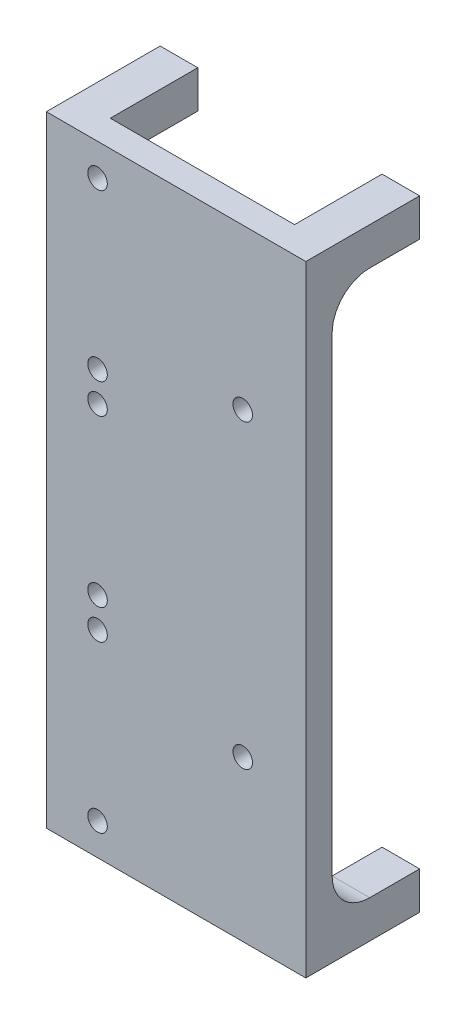
ISO-10303-21;
HEADER;
FILE_DESCRIPTION(('STEP AP214'),'2;1');
FILE_NAME('part.step','',(''),(''),'','','');
FILE_SCHEMA(('AUTOMOTIVE_DESIGN { 1 0 10303 214 1 1 1 1 }'));
ENDSEC;
DATA;
#1=APPLICATION_CONTEXT('core data for automotive mechanical design processes');
#2=APPLICATION_PROTOCOL_DEFINITION('international standard','automotive_design',2000,#1);
#3=PRODUCT_CONTEXT('',#1,'mechanical');
#4=PRODUCT('Part','Part','',(#3));
#5=PRODUCT_RELATED_PRODUCT_CATEGORY('part','',(#4));
#6=PRODUCT_DEFINITION_FORMATION('','',#4);
#7=PRODUCT_DEFINITION_CONTEXT('part definition',#1,'design');
#8=PRODUCT_DEFINITION('design','',#6,#7);
#9=PRODUCT_DEFINITION_SHAPE('','',#8);
#10=(LENGTH_UNIT() NAMED_UNIT(*) SI_UNIT(.MILLI.,.METRE.));
#11=(NAMED_UNIT(*) PLANE_ANGLE_UNIT() SI_UNIT($,.RADIAN.));
#12=(NAMED_UNIT(*) SI_UNIT($,.STERADIAN.) SOLID_ANGLE_UNIT());
#13=UNCERTAINTY_MEASURE_WITH_UNIT(LENGTH_MEASURE(1.E-05),#10,'distance_accuracy_value','');
#14=(GEOMETRIC_REPRESENTATION_CONTEXT(3) GLOBAL_UNCERTAINTY_ASSIGNED_CONTEXT((#13)) GLOBAL_UNIT_ASSIGNED_CONTEXT((#10,
#11,#12)) REPRESENTATION_CONTEXT('',''));
#15=CARTESIAN_POINT('',(0.,0.,0.));
#16=DIRECTION('',(0.,0.,1.));
#17=DIRECTION('',(1.,0.,0.));
#18=AXIS2_PLACEMENT_3D('',#15,#16,#17);
#19=CARTESIAN_POINT('',(0.,0.,0.));
#20=DIRECTION('',(0.,0.,-1.));
#21=DIRECTION('',(-1.,0.,0.));
#22=AXIS2_PLACEMENT_3D('',#19,#20,#21);
#23=PLANE('',#22);
#24=CARTESIAN_POINT('',(71.2675267467333,-59.6714206568418,0.));
#25=DIRECTION('',(0.,0.,-1.));
#26=DIRECTION('',(-1.,0.,0.));
#27=AXIS2_PLACEMENT_3D('',#24,#25,#26);
#28=CIRCLE('',#27,2.6);
#29=CARTESIAN_POINT('',(68.6675267467332,-59.6714206568418,0.));
#30=VERTEX_POINT('',#29);
#31=EDGE_CURVE('E344',#30,#30,#28,.F.);
#32=ORIENTED_EDGE('',*,*,#31,.T.);
#33=EDGE_LOOP('',(#32));
#34=FACE_BOUND('',#33,.T.);
#35=CARTESIAN_POINT('',(71.2675267467333,-15.6714206568418,0.));
#36=DIRECTION('',(0.,0.,-1.));
#37=DIRECTION('',(-1.,0.,0.));
#38=AXIS2_PLACEMENT_3D('',#35,#36,#37);
#39=CIRCLE('',#38,2.6);
#40=CARTESIAN_POINT('',(68.6675267467332,-15.6714206568418,0.));
#41=VERTEX_POINT('',#40);
#42=EDGE_CURVE('E349',#41,#41,#39,.F.);
#43=ORIENTED_EDGE('',*,*,#42,.T.);
#44=EDGE_LOOP('',(#43));
#45=FACE_BOUND('',#44,.T.);
#46=CARTESIAN_POINT('',(71.2675267467333,-7.67142065684181,0.));
#47=DIRECTION('',(0.,0.,-1.));
#48=DIRECTION('',(-1.,0.,0.));
#49=AXIS2_PLACEMENT_3D('',#46,#47,#48);
#50=CIRCLE('',#49,2.6);
#51=CARTESIAN_POINT('',(68.6675267467332,-7.67142065684181,0.));
#52=VERTEX_POINT('',#51);
#53=EDGE_CURVE('E355',#52,#52,#50,.F.);
#54=ORIENTED_EDGE('',*,*,#53,.T.);
#55=EDGE_LOOP('',(#54));
#56=FACE_BOUND('',#55,.T.);
#57=CARTESIAN_POINT('',(71.2675267467333,36.3285793431582,0.));
#58=DIRECTION('',(0.,0.,-1.));
#59=DIRECTION('',(-1.,0.,0.));
#60=AXIS2_PLACEMENT_3D('',#57,#58,#59);
#61=CIRCLE('',#60,2.6);
#62=CARTESIAN_POINT('',(68.6675267467332,36.3285793431582,0.));
#63=VERTEX_POINT('',#62);
#64=EDGE_CURVE('E361',#63,#63,#61,.F.);
#65=ORIENTED_EDGE('',*,*,#64,.T.);
#66=EDGE_LOOP('',(#65));
#67=FACE_BOUND('',#66,.T.);
#68=CARTESIAN_POINT('',(71.2675267467333,44.3285793431582,0.));
#69=DIRECTION('',(0.,0.,-1.));
#70=DIRECTION('',(-1.,0.,0.));
#71=AXIS2_PLACEMENT_3D('',#68,#69,#70);
#72=CIRCLE('',#71,2.6);
#73=CARTESIAN_POINT('',(68.6675267467332,44.3285793431582,0.));
#74=VERTEX_POINT('',#73);
#75=EDGE_CURVE('E367',#74,#74,#72,.F.);
#76=ORIENTED_EDGE('',*,*,#75,.T.);
#77=EDGE_LOOP('',(#76));
#78=FACE_BOUND('',#77,.T.);
#79=CARTESIAN_POINT('',(71.2675267467333,88.3285793431582,0.));
#80=DIRECTION('',(0.,0.,-1.));
#81=DIRECTION('',(-1.,0.,0.));
#82=AXIS2_PLACEMENT_3D('',#79,#80,#81);
#83=CIRCLE('',#82,2.6);
#84=CARTESIAN_POINT('',(68.6675267467332,88.3285793431582,0.));
#85=VERTEX_POINT('',#84);
#86=EDGE_CURVE('E327',#85,#85,#83,.F.);
#87=ORIENTED_EDGE('',*,*,#86,.T.);
#88=EDGE_LOOP('',(#87));
#89=FACE_BOUND('',#88,.T.);
#90=CARTESIAN_POINT('',(109.883329943437,54.3285793431582,0.));
#91=DIRECTION('',(0.,0.,-1.));
#92=DIRECTION('',(-1.,0.,0.));
#93=AXIS2_PLACEMENT_3D('',#90,#91,#92);
#94=CIRCLE('',#93,2.6);
#95=CARTESIAN_POINT('',(107.283329943437,54.3285793431582,0.));
#96=VERTEX_POINT('',#95);
#97=EDGE_CURVE('E197',#96,#96,#94,.F.);
#98=ORIENTED_EDGE('',*,*,#97,.T.);
#99=EDGE_LOOP('',(#98));
#100=FACE_BOUND('',#99,.T.);
#101=CARTESIAN_POINT('',(109.883329943437,-25.6714206568418,0.));
#102=DIRECTION('',(0.,0.,-1.));
#103=DIRECTION('',(-1.,0.,0.));
#104=AXIS2_PLACEMENT_3D('',#101,#102,#103);
#105=CIRCLE('',#104,2.6);
#106=CARTESIAN_POINT('',(107.283329943437,-25.6714206568418,0.));
#107=VERTEX_POINT('',#106);
#108=EDGE_CURVE('E348',#107,#107,#105,.F.);
#109=ORIENTED_EDGE('',*,*,#108,.T.);
#110=EDGE_LOOP('',(#109));
#111=FACE_BOUND('',#110,.T.);
#112=DIRECTION('',(0.,1.,0.));
#113=VECTOR('',#112,1.);
#114=CARTESIAN_POINT('',(116.660418582241,96.8285793431582,0.));
#115=LINE('',#114,#113);
#116=CARTESIAN_POINT('',(116.660418582241,76.8285793431582,0.));
#117=VERTEX_POINT('',#116);
#118=CARTESIAN_POINT('',(116.660418582241,96.8285793431582,0.));
#119=VERTEX_POINT('',#118);
#120=EDGE_CURVE('E52',#117,#119,#115,.T.);
#121=ORIENTED_EDGE('',*,*,#120,.F.);
#122=DIRECTION('',(-1.,0.,0.));
#123=VECTOR('',#122,1.);
#124=CARTESIAN_POINT('',(0.,76.8285793431582,0.));
#125=LINE('',#124,#123);
#126=CARTESIAN_POINT('',(126.660418582241,76.8285793431582,0.));
#127=VERTEX_POINT('',#126);
#128=EDGE_CURVE('E57',#117,#127,#125,.F.);
#129=ORIENTED_EDGE('',*,*,#128,.T.);
#130=DIRECTION('',(0.,1.,0.));
#131=VECTOR('',#130,1.);
#132=CARTESIAN_POINT('',(126.660418582241,-68.1714206568418,0.));
#133=LINE('',#132,#131);
#134=CARTESIAN_POINT('',(126.660418582241,-48.1714206568418,0.));
#135=VERTEX_POINT('',#134);
#136=EDGE_CURVE('E193',#135,#127,#133,.T.);
#137=ORIENTED_EDGE('',*,*,#136,.F.);
#138=DIRECTION('',(-1.,0.,0.));
#139=VECTOR('',#138,1.);
#140=CARTESIAN_POINT('',(116.660418582241,-48.1714206568418,0.));
#141=LINE('',#140,#139);
#142=CARTESIAN_POINT('',(116.660418582241,-48.1714206568418,0.));
#143=VERTEX_POINT('',#142);
#144=EDGE_CURVE('E232',#135,#143,#141,.T.);
#145=ORIENTED_EDGE('',*,*,#144,.T.);
#146=DIRECTION('',(0.,-1.,0.));
#147=VECTOR('',#146,1.);
#148=CARTESIAN_POINT('',(116.660418582241,-68.1714206568418,0.));
#149=LINE('',#148,#147);
#150=CARTESIAN_POINT('',(116.660418582241,-68.1714206568418,0.));
#151=VERTEX_POINT('',#150);
#152=EDGE_CURVE('E262',#143,#151,#149,.T.);
#153=ORIENTED_EDGE('',*,*,#152,.T.);
#154=DIRECTION('',(1.,0.,0.));
#155=VECTOR('',#154,1.);
#156=CARTESIAN_POINT('',(57.660418582241,-68.1714206568418,0.));
#157=LINE('',#156,#155);
#158=CARTESIAN_POINT('',(67.6604185822411,-68.1714206568418,0.));
#159=VERTEX_POINT('',#158);
#160=EDGE_CURVE('E195',#159,#151,#157,.T.);
#161=ORIENTED_EDGE('',*,*,#160,.F.);
#162=DIRECTION('',(0.,-1.,0.));
#163=VECTOR('',#162,1.);
#164=CARTESIAN_POINT('',(67.660418582241,-68.1714206568418,0.));
#165=LINE('',#164,#163);
#166=CARTESIAN_POINT('',(67.6604185822411,-48.1714206568418,0.));
#167=VERTEX_POINT('',#166);
#168=EDGE_CURVE('E314',#167,#159,#165,.T.);
#169=ORIENTED_EDGE('',*,*,#168,.F.);
#170=DIRECTION('',(1.,0.,0.));
#171=VECTOR('',#170,1.);
#172=CARTESIAN_POINT('',(0.,-48.1714206568418,0.));
#173=LINE('',#172,#171);
#174=CARTESIAN_POINT('',(57.660418582241,-48.1714206568418,0.));
#175=VERTEX_POINT('',#174);
#176=EDGE_CURVE('E216',#167,#175,#173,.F.);
#177=ORIENTED_EDGE('',*,*,#176,.T.);
#178=DIRECTION('',(0.,-1.,0.));
#179=VECTOR('',#178,1.);
#180=CARTESIAN_POINT('',(57.660418582241,-68.1714206568418,0.));
#181=LINE('',#180,#179);
#182=CARTESIAN_POINT('',(57.660418582241,76.8285793431582,0.));
#183=VERTEX_POINT('',#182);
#184=EDGE_CURVE('E192',#183,#175,#181,.T.);
#185=ORIENTED_EDGE('',*,*,#184,.F.);
#186=DIRECTION('',(1.,0.,0.));
#187=VECTOR('',#186,1.);
#188=CARTESIAN_POINT('',(67.6604185822411,76.8285793431582,0.));
#189=LINE('',#188,#187);
#190=CARTESIAN_POINT('',(67.6604185822411,76.8285793431582,0.));
#191=VERTEX_POINT('',#190);
#192=EDGE_CURVE('E224',#183,#191,#189,.T.);
#193=ORIENTED_EDGE('',*,*,#192,.T.);
#194=DIRECTION('',(0.,1.,0.));
#195=VECTOR('',#194,1.);
#196=CARTESIAN_POINT('',(67.660418582241,96.8285793431582,0.));
#197=LINE('',#196,#195);
#198=CARTESIAN_POINT('',(67.6604185822411,96.8285793431582,0.));
#199=VERTEX_POINT('',#198);
#200=EDGE_CURVE('E190',#191,#199,#197,.T.);
#201=ORIENTED_EDGE('',*,*,#200,.T.);
#202=DIRECTION('',(-1.,0.,0.));
#203=VECTOR('',#202,1.);
#204=CARTESIAN_POINT('',(57.660418582241,96.8285793431582,0.));
#205=LINE('',#204,#203);
#206=EDGE_CURVE('E177',#119,#199,#205,.T.);
#207=ORIENTED_EDGE('',*,*,#206,.F.);
#208=EDGE_LOOP('',(#121,#129,#137,#145,#153,#161,#169,#177,#185,#193,#201,#207));
#209=FACE_BOUND('',#208,.T.);
#210=ADVANCED_FACE('F37',(#34,#45,#56,#67,#78,#89,#100,#111,#209),#23,.T.);
#211=CARTESIAN_POINT('',(126.660418582241,-68.1714206568418,7.));
#212=DIRECTION('',(-1.,0.,0.));
#213=DIRECTION('',(0.,0.,1.));
#214=AXIS2_PLACEMENT_3D('',#211,#212,#213);
#215=PLANE('',#214);
#216=DIRECTION('',(0.,0.,-1.));
#217=VECTOR('',#216,1.);
#218=CARTESIAN_POINT('',(126.660418582241,-68.1714206568418,7.));
#219=LINE('',#218,#217);
#220=CARTESIAN_POINT('',(126.660418582241,-68.1714206568418,7.));
#221=VERTEX_POINT('',#220);
#222=CARTESIAN_POINT('',(126.660418582241,-68.1714206568418,-23.2641286914007));
#223=VERTEX_POINT('',#222);
#224=EDGE_CURVE('E204',#221,#223,#219,.T.);
#225=ORIENTED_EDGE('',*,*,#224,.T.);
#226=DIRECTION('',(0.,-1.,0.));
#227=VECTOR('',#226,1.);
#228=CARTESIAN_POINT('',(126.660418582241,-68.1714206568419,-23.2641286914007));
#229=LINE('',#228,#227);
#230=CARTESIAN_POINT('',(126.660418582241,-58.1714206568418,-23.2641286914006));
#231=VERTEX_POINT('',#230);
#232=EDGE_CURVE('E272',#231,#223,#229,.T.);
#233=ORIENTED_EDGE('',*,*,#232,.F.);
#234=DIRECTION('',(0.,0.,1.));
#235=VECTOR('',#234,1.);
#236=CARTESIAN_POINT('',(126.660418582241,-58.1714206568418,-37.4062643151316));
#237=LINE('',#236,#235);
#238=CARTESIAN_POINT('',(126.660418582241,-58.1714206568418,-10.));
#239=VERTEX_POINT('',#238);
#240=EDGE_CURVE('E277',#231,#239,#237,.T.);
#241=ORIENTED_EDGE('',*,*,#240,.T.);
#242=CARTESIAN_POINT('',(126.660418582241,-48.1714206568418,-10.));
#243=DIRECTION('',(-1.,0.,0.));
#244=DIRECTION('',(0.,0.,1.));
#245=AXIS2_PLACEMENT_3D('',#242,#243,#244);
#246=CIRCLE('',#245,10.);
#247=EDGE_CURVE('E239',#239,#135,#246,.T.);
#248=ORIENTED_EDGE('',*,*,#247,.T.);
#249=ORIENTED_EDGE('',*,*,#136,.T.);
#250=CARTESIAN_POINT('',(126.660418582241,76.8285793431582,-10.));
#251=DIRECTION('',(-1.,0.,0.));
#252=DIRECTION('',(0.,0.,1.));
#253=AXIS2_PLACEMENT_3D('',#250,#251,#252);
#254=CIRCLE('',#253,10.);
#255=CARTESIAN_POINT('',(126.660418582241,86.8285793431582,-10.));
#256=VERTEX_POINT('',#255);
#257=EDGE_CURVE('E11',#127,#256,#254,.T.);
#258=ORIENTED_EDGE('',*,*,#257,.T.);
#259=DIRECTION('',(0.,0.,1.));
#260=VECTOR('',#259,1.);
#261=CARTESIAN_POINT('',(126.660418582241,86.8285793431582,-37.4062643151301));
#262=LINE('',#261,#260);
#263=CARTESIAN_POINT('',(126.660418582241,86.8285793431582,-23.2641286913992));
#264=VERTEX_POINT('',#263);
#265=EDGE_CURVE('E251',#264,#256,#262,.T.);
#266=ORIENTED_EDGE('',*,*,#265,.F.);
#267=DIRECTION('',(0.,1.,0.));
#268=VECTOR('',#267,1.);
#269=CARTESIAN_POINT('',(126.660418582241,96.8285793431581,-23.2641286913991));
#270=LINE('',#269,#268);
#271=CARTESIAN_POINT('',(126.660418582241,96.8285793431582,-23.2641286913991));
#272=VERTEX_POINT('',#271);
#273=EDGE_CURVE('E266',#264,#272,#270,.T.);
#274=ORIENTED_EDGE('',*,*,#273,.T.);
#275=DIRECTION('',(0.,0.,-1.));
#276=VECTOR('',#275,1.);
#277=CARTESIAN_POINT('',(126.660418582241,96.8285793431582,7.));
#278=LINE('',#277,#276);
#279=CARTESIAN_POINT('',(126.660418582241,96.8285793431582,7.));
#280=VERTEX_POINT('',#279);
#281=EDGE_CURVE('E211',#280,#272,#278,.T.);
#282=ORIENTED_EDGE('',*,*,#281,.F.);
#283=DIRECTION('',(0.,1.,0.));
#284=VECTOR('',#283,1.);
#285=CARTESIAN_POINT('',(126.660418582241,-68.1714206568418,7.));
#286=LINE('',#285,#284);
#287=EDGE_CURVE('E203',#221,#280,#286,.T.);
#288=ORIENTED_EDGE('',*,*,#287,.F.);
#289=EDGE_LOOP('',(#225,#233,#241,#248,#249,#258,#266,#274,#282,#288));
#290=FACE_BOUND('',#289,.T.);
#291=ADVANCED_FACE('F406',(#290),#215,.F.);
#292=CARTESIAN_POINT('',(57.660418582241,96.8285793431582,7.));
#293=DIRECTION('',(0.,-1.,0.));
#294=DIRECTION('',(0.,0.,-1.));
#295=AXIS2_PLACEMENT_3D('',#292,#293,#294);
#296=PLANE('',#295);
#297=ORIENTED_EDGE('',*,*,#281,.T.);
#298=DIRECTION('',(-1.,0.,0.));
#299=VECTOR('',#298,1.);
#300=CARTESIAN_POINT('',(126.660418582241,96.8285793431582,-23.2641286913991));
#301=LINE('',#300,#299);
#302=CARTESIAN_POINT('',(116.660418582241,96.8285793431582,-23.2641286913991));
#303=VERTEX_POINT('',#302);
#304=EDGE_CURVE('E180',#272,#303,#301,.T.);
#305=ORIENTED_EDGE('',*,*,#304,.T.);
#306=DIRECTION('',(0.,0.,1.));
#307=VECTOR('',#306,1.);
#308=CARTESIAN_POINT('',(116.660418582241,96.8285793431582,-37.4062643151301));
#309=LINE('',#308,#307);
#310=EDGE_CURVE('E174',#303,#119,#309,.T.);
#311=ORIENTED_EDGE('',*,*,#310,.T.);
#312=ORIENTED_EDGE('',*,*,#206,.T.);
#313=DIRECTION('',(0.,0.,1.));
#314=VECTOR('',#313,1.);
#315=CARTESIAN_POINT('',(67.660418582241,96.8285793431582,-37.4062643151301));
#316=LINE('',#315,#314);
#317=CARTESIAN_POINT('',(67.660418582241,96.8285793431582,-23.2641286913991));
#318=VERTEX_POINT('',#317);
#319=EDGE_CURVE('E295',#318,#199,#316,.T.);
#320=ORIENTED_EDGE('',*,*,#319,.F.);
#321=DIRECTION('',(1.,0.,0.));
#322=VECTOR('',#321,1.);
#323=CARTESIAN_POINT('',(57.6604185822411,96.8285793431582,-23.2641286913991));
#324=LINE('',#323,#322);
#325=CARTESIAN_POINT('',(57.660418582241,96.8285793431582,-23.2641286913991));
#326=VERTEX_POINT('',#325);
#327=EDGE_CURVE('E294',#326,#318,#324,.T.);
#328=ORIENTED_EDGE('',*,*,#327,.F.);
#329=DIRECTION('',(0.,0.,-1.));
#330=VECTOR('',#329,1.);
#331=CARTESIAN_POINT('',(57.660418582241,96.8285793431582,7.));
#332=LINE('',#331,#330);
#333=CARTESIAN_POINT('',(57.660418582241,96.8285793431582,7.));
#334=VERTEX_POINT('',#333);
#335=EDGE_CURVE('E209',#334,#326,#332,.T.);
#336=ORIENTED_EDGE('',*,*,#335,.F.);
#337=DIRECTION('',(-1.,0.,0.));
#338=VECTOR('',#337,1.);
#339=CARTESIAN_POINT('',(57.660418582241,96.8285793431582,7.));
#340=LINE('',#339,#338);
#341=EDGE_CURVE('E389',#280,#334,#340,.T.);
#342=ORIENTED_EDGE('',*,*,#341,.F.);
#343=EDGE_LOOP('',(#297,#305,#311,#312,#320,#328,#336,#342));
#344=FACE_BOUND('',#343,.T.);
#345=ADVANCED_FACE('F175',(#344),#296,.F.);
#346=CARTESIAN_POINT('',(57.660418582241,-68.1714206568418,7.));
#347=DIRECTION('',(1.,0.,0.));
#348=DIRECTION('',(0.,0.,-1.));
#349=AXIS2_PLACEMENT_3D('',#346,#347,#348);
#350=PLANE('',#349);
#351=ORIENTED_EDGE('',*,*,#335,.T.);
#352=DIRECTION('',(0.,1.,0.));
#353=VECTOR('',#352,1.);
#354=CARTESIAN_POINT('',(57.660418582241,96.8285793431581,-23.2641286913991));
#355=LINE('',#354,#353);
#356=CARTESIAN_POINT('',(57.660418582241,86.8285793431582,-23.2641286913992));
#357=VERTEX_POINT('',#356);
#358=EDGE_CURVE('E297',#357,#326,#355,.T.);
#359=ORIENTED_EDGE('',*,*,#358,.F.);
#360=DIRECTION('',(0.,0.,1.));
#361=VECTOR('',#360,1.);
#362=CARTESIAN_POINT('',(57.660418582241,86.8285793431582,-37.4062643151301));
#363=LINE('',#362,#361);
#364=CARTESIAN_POINT('',(57.660418582241,86.8285793431582,-10.));
#365=VERTEX_POINT('',#364);
#366=EDGE_CURVE('E302',#357,#365,#363,.T.);
#367=ORIENTED_EDGE('',*,*,#366,.T.);
#368=CARTESIAN_POINT('',(57.660418582241,76.8285793431582,-10.));
#369=DIRECTION('',(1.,0.,0.));
#370=DIRECTION('',(0.,0.,-1.));
#371=AXIS2_PLACEMENT_3D('',#368,#369,#370);
#372=CIRCLE('',#371,10.);
#373=EDGE_CURVE('E230',#365,#183,#372,.T.);
#374=ORIENTED_EDGE('',*,*,#373,.T.);
#375=ORIENTED_EDGE('',*,*,#184,.T.);
#376=CARTESIAN_POINT('',(57.660418582241,-48.1714206568418,-10.));
#377=DIRECTION('',(1.,0.,0.));
#378=DIRECTION('',(0.,0.,-1.));
#379=AXIS2_PLACEMENT_3D('',#376,#377,#378);
#380=CIRCLE('',#379,10.);
#381=CARTESIAN_POINT('',(57.660418582241,-58.1714206568418,-10.));
#382=VERTEX_POINT('',#381);
#383=EDGE_CURVE('E222',#175,#382,#380,.T.);
#384=ORIENTED_EDGE('',*,*,#383,.T.);
#385=DIRECTION('',(0.,0.,1.));
#386=VECTOR('',#385,1.);
#387=CARTESIAN_POINT('',(57.660418582241,-58.1714206568418,-37.4062643151315));
#388=LINE('',#387,#386);
#389=CARTESIAN_POINT('',(57.660418582241,-58.1714206568418,-23.2641286914005));
#390=VERTEX_POINT('',#389);
#391=EDGE_CURVE('E336',#390,#382,#388,.T.);
#392=ORIENTED_EDGE('',*,*,#391,.F.);
#393=DIRECTION('',(0.,-1.,0.));
#394=VECTOR('',#393,1.);
#395=CARTESIAN_POINT('',(57.660418582241,-68.1714206568419,-23.2641286914006));
#396=LINE('',#395,#394);
#397=CARTESIAN_POINT('',(57.660418582241,-68.1714206568418,-23.2641286914006));
#398=VERTEX_POINT('',#397);
#399=EDGE_CURVE('E324',#390,#398,#396,.T.);
#400=ORIENTED_EDGE('',*,*,#399,.T.);
#401=DIRECTION('',(0.,0.,-1.));
#402=VECTOR('',#401,1.);
#403=CARTESIAN_POINT('',(57.660418582241,-68.1714206568418,7.));
#404=LINE('',#403,#402);
#405=CARTESIAN_POINT('',(57.660418582241,-68.1714206568418,7.));
#406=VERTEX_POINT('',#405);
#407=EDGE_CURVE('E206',#406,#398,#404,.T.);
#408=ORIENTED_EDGE('',*,*,#407,.F.);
#409=DIRECTION('',(0.,-1.,0.));
#410=VECTOR('',#409,1.);
#411=CARTESIAN_POINT('',(57.660418582241,-68.1714206568418,7.));
#412=LINE('',#411,#410);
#413=EDGE_CURVE('E391',#334,#406,#412,.T.);
#414=ORIENTED_EDGE('',*,*,#413,.F.);
#415=EDGE_LOOP('',(#351,#359,#367,#374,#375,#384,#392,#400,#408,#414));
#416=FACE_BOUND('',#415,.T.);
#417=ADVANCED_FACE('F452',(#416),#350,.F.);
#418=CARTESIAN_POINT('',(57.660418582241,-68.1714206568418,7.));
#419=DIRECTION('',(0.,1.,0.));
#420=DIRECTION('',(0.,0.,1.));
#421=AXIS2_PLACEMENT_3D('',#418,#419,#420);
#422=PLANE('',#421);
#423=ORIENTED_EDGE('',*,*,#407,.T.);
#424=DIRECTION('',(1.,0.,0.));
#425=VECTOR('',#424,1.);
#426=CARTESIAN_POINT('',(57.6604185822411,-68.1714206568418,-23.2641286914006));
#427=LINE('',#426,#425);
#428=CARTESIAN_POINT('',(67.660418582241,-68.1714206568418,-23.2641286914006));
#429=VERTEX_POINT('',#428);
#430=EDGE_CURVE('E321',#398,#429,#427,.T.);
#431=ORIENTED_EDGE('',*,*,#430,.T.);
#432=DIRECTION('',(0.,0.,1.));
#433=VECTOR('',#432,1.);
#434=CARTESIAN_POINT('',(67.660418582241,-68.1714206568418,-37.4062643151315));
#435=LINE('',#434,#433);
#436=EDGE_CURVE('E330',#429,#159,#435,.T.);
#437=ORIENTED_EDGE('',*,*,#436,.T.);
#438=ORIENTED_EDGE('',*,*,#160,.T.);
#439=DIRECTION('',(0.,0.,1.));
#440=VECTOR('',#439,1.);
#441=CARTESIAN_POINT('',(116.660418582241,-68.1714206568418,-37.4062643151316));
#442=LINE('',#441,#440);
#443=CARTESIAN_POINT('',(116.660418582241,-68.1714206568418,-23.2641286914007));
#444=VERTEX_POINT('',#443);
#445=EDGE_CURVE('E270',#444,#151,#442,.T.);
#446=ORIENTED_EDGE('',*,*,#445,.F.);
#447=DIRECTION('',(-1.,0.,0.));
#448=VECTOR('',#447,1.);
#449=CARTESIAN_POINT('',(126.660418582241,-68.1714206568418,-23.2641286914007));
#450=LINE('',#449,#448);
#451=EDGE_CURVE('E269',#223,#444,#450,.T.);
#452=ORIENTED_EDGE('',*,*,#451,.F.);
#453=ORIENTED_EDGE('',*,*,#224,.F.);
#454=DIRECTION('',(1.,0.,0.));
#455=VECTOR('',#454,1.);
#456=CARTESIAN_POINT('',(57.660418582241,-68.1714206568418,7.));
#457=LINE('',#456,#455);
#458=EDGE_CURVE('E207',#406,#221,#457,.T.);
#459=ORIENTED_EDGE('',*,*,#458,.F.);
#460=EDGE_LOOP('',(#423,#431,#437,#438,#446,#452,#453,#459));
#461=FACE_BOUND('',#460,.T.);
#462=ADVANCED_FACE('F402',(#461),#422,.F.);
#463=CARTESIAN_POINT('',(0.,0.,7.));
#464=DIRECTION('',(0.,0.,-1.));
#465=DIRECTION('',(-1.,0.,0.));
#466=AXIS2_PLACEMENT_3D('',#463,#464,#465);
#467=PLANE('',#466);
#468=CARTESIAN_POINT('',(71.2675267467333,-59.6714206568418,7.));
#469=DIRECTION('',(0.,0.,1.));
#470=DIRECTION('',(1.,0.,0.));
#471=AXIS2_PLACEMENT_3D('',#468,#469,#470);
#472=CIRCLE('',#471,2.6);
#473=CARTESIAN_POINT('',(73.8675267467333,-59.6714206568418,7.));
#474=VERTEX_POINT('',#473);
#475=EDGE_CURVE('E341',#474,#474,#472,.T.);
#476=ORIENTED_EDGE('',*,*,#475,.F.);
#477=EDGE_LOOP('',(#476));
#478=FACE_BOUND('',#477,.T.);
#479=CARTESIAN_POINT('',(71.2675267467333,-15.6714206568418,7.));
#480=DIRECTION('',(0.,0.,1.));
#481=DIRECTION('',(1.,0.,0.));
#482=AXIS2_PLACEMENT_3D('',#479,#480,#481);
#483=CIRCLE('',#482,2.6);
#484=CARTESIAN_POINT('',(73.8675267467333,-15.6714206568418,7.));
#485=VERTEX_POINT('',#484);
#486=EDGE_CURVE('E345',#485,#485,#483,.T.);
#487=ORIENTED_EDGE('',*,*,#486,.F.);
#488=EDGE_LOOP('',(#487));
#489=FACE_BOUND('',#488,.T.);
#490=CARTESIAN_POINT('',(71.2675267467333,-7.67142065684181,7.));
#491=DIRECTION('',(0.,0.,1.));
#492=DIRECTION('',(1.,0.,0.));
#493=AXIS2_PLACEMENT_3D('',#490,#491,#492);
#494=CIRCLE('',#493,2.6);
#495=CARTESIAN_POINT('',(73.8675267467333,-7.67142065684181,7.));
#496=VERTEX_POINT('',#495);
#497=EDGE_CURVE('E352',#496,#496,#494,.T.);
#498=ORIENTED_EDGE('',*,*,#497,.F.);
#499=EDGE_LOOP('',(#498));
#500=FACE_BOUND('',#499,.T.);
#501=CARTESIAN_POINT('',(71.2675267467333,36.3285793431582,7.));
#502=DIRECTION('',(0.,0.,1.));
#503=DIRECTION('',(1.,0.,0.));
#504=AXIS2_PLACEMENT_3D('',#501,#502,#503);
#505=CIRCLE('',#504,2.6);
#506=CARTESIAN_POINT('',(73.8675267467333,36.3285793431582,7.));
#507=VERTEX_POINT('',#506);
#508=EDGE_CURVE('E358',#507,#507,#505,.T.);
#509=ORIENTED_EDGE('',*,*,#508,.F.);
#510=EDGE_LOOP('',(#509));
#511=FACE_BOUND('',#510,.T.);
#512=CARTESIAN_POINT('',(71.2675267467333,44.3285793431582,7.));
#513=DIRECTION('',(0.,0.,1.));
#514=DIRECTION('',(1.,0.,0.));
#515=AXIS2_PLACEMENT_3D('',#512,#513,#514);
#516=CIRCLE('',#515,2.6);
#517=CARTESIAN_POINT('',(73.8675267467333,44.3285793431582,7.));
#518=VERTEX_POINT('',#517);
#519=EDGE_CURVE('E364',#518,#518,#516,.T.);
#520=ORIENTED_EDGE('',*,*,#519,.F.);
#521=EDGE_LOOP('',(#520));
#522=FACE_BOUND('',#521,.T.);
#523=CARTESIAN_POINT('',(71.2675267467333,88.3285793431582,7.));
#524=DIRECTION('',(0.,0.,1.));
#525=DIRECTION('',(1.,0.,0.));
#526=AXIS2_PLACEMENT_3D('',#523,#524,#525);
#527=CIRCLE('',#526,2.6);
#528=CARTESIAN_POINT('',(73.8675267467333,88.3285793431582,7.));
#529=VERTEX_POINT('',#528);
#530=EDGE_CURVE('E370',#529,#529,#527,.T.);
#531=ORIENTED_EDGE('',*,*,#530,.F.);
#532=EDGE_LOOP('',(#531));
#533=FACE_BOUND('',#532,.T.);
#534=CARTESIAN_POINT('',(109.883329943437,54.3285793431582,7.));
#535=DIRECTION('',(0.,0.,1.));
#536=DIRECTION('',(1.,0.,0.));
#537=AXIS2_PLACEMENT_3D('',#534,#535,#536);
#538=CIRCLE('',#537,2.6);
#539=CARTESIAN_POINT('',(112.483329943437,54.3285793431582,7.));
#540=VERTEX_POINT('',#539);
#541=EDGE_CURVE('E377',#540,#540,#538,.T.);
#542=ORIENTED_EDGE('',*,*,#541,.F.);
#543=EDGE_LOOP('',(#542));
#544=FACE_BOUND('',#543,.T.);
#545=CARTESIAN_POINT('',(109.883329943437,-25.6714206568418,7.));
#546=DIRECTION('',(0.,0.,1.));
#547=DIRECTION('',(1.,0.,0.));
#548=AXIS2_PLACEMENT_3D('',#545,#546,#547);
#549=CIRCLE('',#548,2.6);
#550=CARTESIAN_POINT('',(112.483329943437,-25.6714206568418,7.));
#551=VERTEX_POINT('',#550);
#552=EDGE_CURVE('E380',#551,#551,#549,.T.);
#553=ORIENTED_EDGE('',*,*,#552,.F.);
#554=EDGE_LOOP('',(#553));
#555=FACE_BOUND('',#554,.T.);
#556=ORIENTED_EDGE('',*,*,#287,.T.);
#557=ORIENTED_EDGE('',*,*,#341,.T.);
#558=ORIENTED_EDGE('',*,*,#413,.T.);
#559=ORIENTED_EDGE('',*,*,#458,.T.);
#560=EDGE_LOOP('',(#556,#557,#558,#559));
#561=FACE_BOUND('',#560,.T.);
#562=ADVANCED_FACE('F395',(#478,#489,#500,#511,#522,#533,#544,#555,#561),#467,.F.);
#563=CARTESIAN_POINT('',(109.883329943437,-25.6714206568418,-7.35391052434011));
#564=DIRECTION('',(0.,0.,1.));
#565=DIRECTION('',(1.,0.,0.));
#566=AXIS2_PLACEMENT_3D('',#563,#564,#565);
#567=CYLINDRICAL_SURFACE('',#566,2.6);
#568=ORIENTED_EDGE('',*,*,#552,.T.);
#569=EDGE_LOOP('',(#568));
#570=FACE_BOUND('',#569,.T.);
#571=ORIENTED_EDGE('',*,*,#108,.F.);
#572=EDGE_LOOP('',(#571));
#573=FACE_BOUND('',#572,.T.);
#574=ADVANCED_FACE('F568',(#570,#573),#567,.F.);
#575=CARTESIAN_POINT('',(109.883329943437,54.3285793431582,-7.35391052434011));
#576=DIRECTION('',(0.,0.,1.));
#577=DIRECTION('',(1.,0.,0.));
#578=AXIS2_PLACEMENT_3D('',#575,#576,#577);
#579=CYLINDRICAL_SURFACE('',#578,2.6);
#580=ORIENTED_EDGE('',*,*,#541,.T.);
#581=EDGE_LOOP('',(#580));
#582=FACE_BOUND('',#581,.T.);
#583=ORIENTED_EDGE('',*,*,#97,.F.);
#584=EDGE_LOOP('',(#583));
#585=FACE_BOUND('',#584,.T.);
#586=ADVANCED_FACE('F565',(#582,#585),#579,.F.);
#587=CARTESIAN_POINT('',(71.2675267467333,88.3285793431582,-7.35391052434011));
#588=DIRECTION('',(0.,0.,1.));
#589=DIRECTION('',(1.,0.,0.));
#590=AXIS2_PLACEMENT_3D('',#587,#588,#589);
#591=CYLINDRICAL_SURFACE('',#590,2.6);
#592=ORIENTED_EDGE('',*,*,#530,.T.);
#593=EDGE_LOOP('',(#592));
#594=FACE_BOUND('',#593,.T.);
#595=ORIENTED_EDGE('',*,*,#86,.F.);
#596=EDGE_LOOP('',(#595));
#597=FACE_BOUND('',#596,.T.);
#598=ADVANCED_FACE('F561',(#594,#597),#591,.F.);
#599=CARTESIAN_POINT('',(71.2675267467333,44.3285793431582,-7.35391052434011));
#600=DIRECTION('',(0.,0.,1.));
#601=DIRECTION('',(1.,0.,0.));
#602=AXIS2_PLACEMENT_3D('',#599,#600,#601);
#603=CYLINDRICAL_SURFACE('',#602,2.6);
#604=ORIENTED_EDGE('',*,*,#519,.T.);
#605=EDGE_LOOP('',(#604));
#606=FACE_BOUND('',#605,.T.);
#607=ORIENTED_EDGE('',*,*,#75,.F.);
#608=EDGE_LOOP('',(#607));
#609=FACE_BOUND('',#608,.T.);
#610=ADVANCED_FACE('F557',(#606,#609),#603,.F.);
#611=CARTESIAN_POINT('',(71.2675267467333,36.3285793431582,-7.35391052434011));
#612=DIRECTION('',(0.,0.,1.));
#613=DIRECTION('',(1.,0.,0.));
#614=AXIS2_PLACEMENT_3D('',#611,#612,#613);
#615=CYLINDRICAL_SURFACE('',#614,2.6);
#616=ORIENTED_EDGE('',*,*,#508,.T.);
#617=EDGE_LOOP('',(#616));
#618=FACE_BOUND('',#617,.T.);
#619=ORIENTED_EDGE('',*,*,#64,.F.);
#620=EDGE_LOOP('',(#619));
#621=FACE_BOUND('',#620,.T.);
#622=ADVANCED_FACE('F553',(#618,#621),#615,.F.);
#623=CARTESIAN_POINT('',(71.2675267467333,-7.67142065684181,-7.35391052434011));
#624=DIRECTION('',(0.,0.,1.));
#625=DIRECTION('',(1.,0.,0.));
#626=AXIS2_PLACEMENT_3D('',#623,#624,#625);
#627=CYLINDRICAL_SURFACE('',#626,2.6);
#628=ORIENTED_EDGE('',*,*,#497,.T.);
#629=EDGE_LOOP('',(#628));
#630=FACE_BOUND('',#629,.T.);
#631=ORIENTED_EDGE('',*,*,#53,.F.);
#632=EDGE_LOOP('',(#631));
#633=FACE_BOUND('',#632,.T.);
#634=ADVANCED_FACE('F549',(#630,#633),#627,.F.);
#635=CARTESIAN_POINT('',(71.2675267467333,-15.6714206568418,-7.35391052434011));
#636=DIRECTION('',(0.,0.,1.));
#637=DIRECTION('',(1.,0.,0.));
#638=AXIS2_PLACEMENT_3D('',#635,#636,#637);
#639=CYLINDRICAL_SURFACE('',#638,2.6);
#640=ORIENTED_EDGE('',*,*,#486,.T.);
#641=EDGE_LOOP('',(#640));
#642=FACE_BOUND('',#641,.T.);
#643=ORIENTED_EDGE('',*,*,#42,.F.);
#644=EDGE_LOOP('',(#643));
#645=FACE_BOUND('',#644,.T.);
#646=ADVANCED_FACE('F545',(#642,#645),#639,.F.);
#647=CARTESIAN_POINT('',(71.2675267467333,-59.6714206568418,-7.35391052434011));
#648=DIRECTION('',(0.,0.,1.));
#649=DIRECTION('',(1.,0.,0.));
#650=AXIS2_PLACEMENT_3D('',#647,#648,#649);
#651=CYLINDRICAL_SURFACE('',#650,2.6);
#652=ORIENTED_EDGE('',*,*,#475,.T.);
#653=EDGE_LOOP('',(#652));
#654=FACE_BOUND('',#653,.T.);
#655=ORIENTED_EDGE('',*,*,#31,.F.);
#656=EDGE_LOOP('',(#655));
#657=FACE_BOUND('',#656,.T.);
#658=ADVANCED_FACE('F538',(#654,#657),#651,.F.);
#659=CARTESIAN_POINT('',(67.660418582241,-68.1714206568418,-37.4062643151315));
#660=DIRECTION('',(-1.,0.,0.));
#661=DIRECTION('',(0.,-1.,0.));
#662=AXIS2_PLACEMENT_3D('',#659,#660,#661);
#663=PLANE('',#662);
#664=ORIENTED_EDGE('',*,*,#436,.F.);
#665=DIRECTION('',(0.,1.,0.));
#666=VECTOR('',#665,1.);
#667=CARTESIAN_POINT('',(67.660418582241,-68.1714206568419,-23.2641286914006));
#668=LINE('',#667,#666);
#669=CARTESIAN_POINT('',(67.6604185822411,-58.1714206568418,-23.2641286914005));
#670=VERTEX_POINT('',#669);
#671=EDGE_CURVE('E317',#429,#670,#668,.T.);
#672=ORIENTED_EDGE('',*,*,#671,.T.);
#673=DIRECTION('',(0.,0.,1.));
#674=VECTOR('',#673,1.);
#675=CARTESIAN_POINT('',(67.6604185822411,-58.1714206568418,-37.4062643151315));
#676=LINE('',#675,#674);
#677=CARTESIAN_POINT('',(67.6604185822411,-58.1714206568418,-10.));
#678=VERTEX_POINT('',#677);
#679=EDGE_CURVE('E333',#670,#678,#676,.T.);
#680=ORIENTED_EDGE('',*,*,#679,.T.);
#681=CARTESIAN_POINT('',(67.6604185822411,-48.1714206568418,-10.));
#682=DIRECTION('',(-1.,0.,0.));
#683=DIRECTION('',(0.,-1.,0.));
#684=AXIS2_PLACEMENT_3D('',#681,#682,#683);
#685=CIRCLE('',#684,10.);
#686=EDGE_CURVE('E219',#678,#167,#685,.T.);
#687=ORIENTED_EDGE('',*,*,#686,.T.);
#688=ORIENTED_EDGE('',*,*,#168,.T.);
#689=EDGE_LOOP('',(#664,#672,#680,#687,#688));
#690=FACE_BOUND('',#689,.T.);
#691=ADVANCED_FACE('F535',(#690),#663,.F.);
#692=CARTESIAN_POINT('',(57.660418582241,-58.1714206568418,-37.4062643151315));
#693=DIRECTION('',(0.,-1.,0.));
#694=DIRECTION('',(0.,0.,-1.));
#695=AXIS2_PLACEMENT_3D('',#692,#693,#694);
#696=PLANE('',#695);
#697=ORIENTED_EDGE('',*,*,#391,.T.);
#698=DIRECTION('',(1.,0.,0.));
#699=VECTOR('',#698,1.);
#700=CARTESIAN_POINT('',(57.660418582241,-58.1714206568418,-10.));
#701=LINE('',#700,#699);
#702=EDGE_CURVE('E213',#382,#678,#701,.T.);
#703=ORIENTED_EDGE('',*,*,#702,.T.);
#704=ORIENTED_EDGE('',*,*,#679,.F.);
#705=DIRECTION('',(-1.,0.,0.));
#706=VECTOR('',#705,1.);
#707=CARTESIAN_POINT('',(57.6604185822411,-58.1714206568418,-23.2641286914005));
#708=LINE('',#707,#706);
#709=EDGE_CURVE('E320',#670,#390,#708,.T.);
#710=ORIENTED_EDGE('',*,*,#709,.T.);
#711=EDGE_LOOP('',(#697,#703,#704,#710));
#712=FACE_BOUND('',#711,.T.);
#713=ADVANCED_FACE('F533',(#712),#696,.F.);
#714=CARTESIAN_POINT('',(134.160418582235,14.3285793431537,-23.2641286913999));
#715=DIRECTION('',(0.,0.,1.));
#716=DIRECTION('',(0.,1.,0.));
#717=AXIS2_PLACEMENT_3D('',#714,#715,#716);
#718=PLANE('',#717);
#719=CARTESIAN_POINT('',(62.6604185822411,-63.1714206568418,-23.2641286914006));
#720=DIRECTION('',(0.,0.,-1.));
#721=DIRECTION('',(0.,1.,0.));
#722=AXIS2_PLACEMENT_3D('',#719,#720,#721);
#723=CIRCLE('',#722,2.25);
#724=CARTESIAN_POINT('',(62.6604185822411,-60.9214206568418,-23.2641286914006));
#725=VERTEX_POINT('',#724);
#726=EDGE_CURVE('E310',#725,#725,#723,.T.);
#727=ORIENTED_EDGE('',*,*,#726,.F.);
#728=EDGE_LOOP('',(#727));
#729=FACE_BOUND('',#728,.T.);
#730=ORIENTED_EDGE('',*,*,#709,.F.);
#731=ORIENTED_EDGE('',*,*,#671,.F.);
#732=ORIENTED_EDGE('',*,*,#430,.F.);
#733=ORIENTED_EDGE('',*,*,#399,.F.);
#734=EDGE_LOOP('',(#730,#731,#732,#733));
#735=FACE_BOUND('',#734,.T.);
#736=ADVANCED_FACE('F529',(#729,#735),#718,.F.);
#737=CARTESIAN_POINT('',(62.6604185822411,-63.1714206568419,-13.2641286914006));
#738=DIRECTION('',(0.,0.,-1.));
#739=DIRECTION('',(0.,1.,0.));
#740=AXIS2_PLACEMENT_3D('',#737,#738,#739);
#741=CYLINDRICAL_SURFACE('',#740,2.25);
#742=CARTESIAN_POINT('',(62.6604185822411,-63.1714206568419,-13.2641286914006));
#743=DIRECTION('',(0.,0.,-1.));
#744=DIRECTION('',(0.,1.,0.));
#745=AXIS2_PLACEMENT_3D('',#742,#743,#744);
#746=CIRCLE('',#745,2.25);
#747=CARTESIAN_POINT('',(62.6604185822411,-60.9214206568419,-13.2641286914006));
#748=VERTEX_POINT('',#747);
#749=EDGE_CURVE('E311',#748,#748,#746,.T.);
#750=ORIENTED_EDGE('',*,*,#749,.F.);
#751=EDGE_LOOP('',(#750));
#752=FACE_BOUND('',#751,.T.);
#753=ORIENTED_EDGE('',*,*,#726,.T.);
#754=EDGE_LOOP('',(#753));
#755=FACE_BOUND('',#754,.T.);
#756=ADVANCED_FACE('F525',(#752,#755),#741,.F.);
#757=CARTESIAN_POINT('',(62.6604185822411,-63.1714206568419,-13.2641286914006));
#758=DIRECTION('',(0.,0.,-1.));
#759=DIRECTION('',(0.,1.,0.));
#760=AXIS2_PLACEMENT_3D('',#757,#758,#759);
#761=PLANE('',#760);
#762=ORIENTED_EDGE('',*,*,#749,.T.);
#763=EDGE_LOOP('',(#762));
#764=FACE_BOUND('',#763,.T.);
#765=ADVANCED_FACE('F462',(#764),#761,.T.);
#766=CARTESIAN_POINT('',(57.660418582241,-48.1714206568418,-10.));
#767=DIRECTION('',(1.,0.,0.));
#768=DIRECTION('',(0.,0.,-1.));
#769=AXIS2_PLACEMENT_3D('',#766,#767,#768);
#770=CYLINDRICAL_SURFACE('',#769,10.);
#771=ORIENTED_EDGE('',*,*,#383,.F.);
#772=ORIENTED_EDGE('',*,*,#176,.F.);
#773=ORIENTED_EDGE('',*,*,#686,.F.);
#774=ORIENTED_EDGE('',*,*,#702,.F.);
#775=EDGE_LOOP('',(#771,#772,#773,#774));
#776=FACE_BOUND('',#775,.T.);
#777=ADVANCED_FACE('F458',(#776),#770,.F.);
#778=CARTESIAN_POINT('',(67.660418582241,96.8285793431582,-37.4062643151301));
#779=DIRECTION('',(1.,0.,0.));
#780=DIRECTION('',(0.,1.,0.));
#781=AXIS2_PLACEMENT_3D('',#778,#779,#780);
#782=PLANE('',#781);
#783=DIRECTION('',(0.,-1.,0.));
#784=VECTOR('',#783,1.);
#785=CARTESIAN_POINT('',(67.660418582241,96.8285793431581,-23.2641286913991));
#786=LINE('',#785,#784);
#787=CARTESIAN_POINT('',(67.6604185822411,86.8285793431582,-23.2641286913992));
#788=VERTEX_POINT('',#787);
#789=EDGE_CURVE('E292',#318,#788,#786,.T.);
#790=ORIENTED_EDGE('',*,*,#789,.F.);
#791=ORIENTED_EDGE('',*,*,#319,.T.);
#792=ORIENTED_EDGE('',*,*,#200,.F.);
#793=CARTESIAN_POINT('',(67.6604185822411,76.8285793431582,-10.));
#794=DIRECTION('',(1.,0.,0.));
#795=DIRECTION('',(0.,1.,0.));
#796=AXIS2_PLACEMENT_3D('',#793,#794,#795);
#797=CIRCLE('',#796,10.);
#798=CARTESIAN_POINT('',(67.6604185822411,86.8285793431582,-10.));
#799=VERTEX_POINT('',#798);
#800=EDGE_CURVE('E228',#191,#799,#797,.F.);
#801=ORIENTED_EDGE('',*,*,#800,.T.);
#802=DIRECTION('',(0.,0.,1.));
#803=VECTOR('',#802,1.);
#804=CARTESIAN_POINT('',(67.6604185822411,86.8285793431582,-37.4062643151301));
#805=LINE('',#804,#803);
#806=EDGE_CURVE('E305',#788,#799,#805,.T.);
#807=ORIENTED_EDGE('',*,*,#806,.F.);
#808=EDGE_LOOP('',(#790,#791,#792,#801,#807));
#809=FACE_BOUND('',#808,.T.);
#810=ADVANCED_FACE('F461',(#809),#782,.T.);
#811=CARTESIAN_POINT('',(57.660418582241,86.8285793431582,-37.4062643151301));
#812=DIRECTION('',(0.,-1.,0.));
#813=DIRECTION('',(0.,0.,-1.));
#814=AXIS2_PLACEMENT_3D('',#811,#812,#813);
#815=PLANE('',#814);
#816=ORIENTED_EDGE('',*,*,#806,.T.);
#817=DIRECTION('',(1.,0.,0.));
#818=VECTOR('',#817,1.);
#819=CARTESIAN_POINT('',(57.660418582241,86.8285793431582,-10.));
#820=LINE('',#819,#818);
#821=EDGE_CURVE('E226',#799,#365,#820,.F.);
#822=ORIENTED_EDGE('',*,*,#821,.T.);
#823=ORIENTED_EDGE('',*,*,#366,.F.);
#824=DIRECTION('',(-1.,0.,0.));
#825=VECTOR('',#824,1.);
#826=CARTESIAN_POINT('',(57.6604185822411,86.8285793431582,-23.2641286913992));
#827=LINE('',#826,#825);
#828=EDGE_CURVE('E300',#788,#357,#827,.T.);
#829=ORIENTED_EDGE('',*,*,#828,.F.);
#830=EDGE_LOOP('',(#816,#822,#823,#829));
#831=FACE_BOUND('',#830,.T.);
#832=ADVANCED_FACE('F515',(#831),#815,.T.);
#833=CARTESIAN_POINT('',(134.160418582235,14.3285793431537,-23.2641286913999));
#834=DIRECTION('',(0.,0.,1.));
#835=DIRECTION('',(0.,1.,0.));
#836=AXIS2_PLACEMENT_3D('',#833,#834,#835);
#837=PLANE('',#836);
#838=CARTESIAN_POINT('',(62.6604185822411,91.8285793431582,-23.2641286914006));
#839=DIRECTION('',(0.,0.,1.));
#840=DIRECTION('',(0.,-1.,0.));
#841=AXIS2_PLACEMENT_3D('',#838,#839,#840);
#842=CIRCLE('',#841,2.25);
#843=CARTESIAN_POINT('',(62.6604185822411,89.5785793431582,-23.2641286914006));
#844=VERTEX_POINT('',#843);
#845=EDGE_CURVE('E286',#844,#844,#842,.T.);
#846=ORIENTED_EDGE('',*,*,#845,.T.);
#847=EDGE_LOOP('',(#846));
#848=FACE_BOUND('',#847,.T.);
#849=ORIENTED_EDGE('',*,*,#358,.T.);
#850=ORIENTED_EDGE('',*,*,#327,.T.);
#851=ORIENTED_EDGE('',*,*,#789,.T.);
#852=ORIENTED_EDGE('',*,*,#828,.T.);
#853=EDGE_LOOP('',(#849,#850,#851,#852));
#854=FACE_BOUND('',#853,.T.);
#855=ADVANCED_FACE('F511',(#848,#854),#837,.F.);
#856=CARTESIAN_POINT('',(62.6604185822411,91.8285793431583,-13.2641286914006));
#857=DIRECTION('',(0.,0.,-1.));
#858=DIRECTION('',(0.,1.,0.));
#859=AXIS2_PLACEMENT_3D('',#856,#857,#858);
#860=CYLINDRICAL_SURFACE('',#859,2.25);
#861=CARTESIAN_POINT('',(62.6604185822411,91.8285793431583,-13.2641286914006));
#862=DIRECTION('',(0.,0.,1.));
#863=DIRECTION('',(0.,-1.,0.));
#864=AXIS2_PLACEMENT_3D('',#861,#862,#863);
#865=CIRCLE('',#864,2.25);
#866=CARTESIAN_POINT('',(62.6604185822411,89.5785793431583,-13.2641286914006));
#867=VERTEX_POINT('',#866);
#868=EDGE_CURVE('E287',#867,#867,#865,.T.);
#869=ORIENTED_EDGE('',*,*,#868,.T.);
#870=EDGE_LOOP('',(#869));
#871=FACE_BOUND('',#870,.T.);
#872=ORIENTED_EDGE('',*,*,#845,.F.);
#873=EDGE_LOOP('',(#872));
#874=FACE_BOUND('',#873,.T.);
#875=ADVANCED_FACE('F507',(#871,#874),#860,.F.);
#876=CARTESIAN_POINT('',(62.6604185822411,91.8285793431583,-13.2641286914006));
#877=DIRECTION('',(0.,0.,-1.));
#878=DIRECTION('',(0.,-1.,0.));
#879=AXIS2_PLACEMENT_3D('',#876,#877,#878);
#880=PLANE('',#879);
#881=ORIENTED_EDGE('',*,*,#868,.F.);
#882=EDGE_LOOP('',(#881));
#883=FACE_BOUND('',#882,.T.);
#884=ADVANCED_FACE('F467',(#883),#880,.T.);
#885=CARTESIAN_POINT('',(0.,76.8285793431582,-10.));
#886=DIRECTION('',(-1.,0.,0.));
#887=DIRECTION('',(0.,0.,1.));
#888=AXIS2_PLACEMENT_3D('',#885,#886,#887);
#889=CYLINDRICAL_SURFACE('',#888,10.);
#890=ORIENTED_EDGE('',*,*,#373,.F.);
#891=ORIENTED_EDGE('',*,*,#821,.F.);
#892=ORIENTED_EDGE('',*,*,#800,.F.);
#893=ORIENTED_EDGE('',*,*,#192,.F.);
#894=EDGE_LOOP('',(#890,#891,#892,#893));
#895=FACE_BOUND('',#894,.T.);
#896=ADVANCED_FACE('F464',(#895),#889,.F.);
#897=CARTESIAN_POINT('',(116.660418582241,-68.1714206568418,-37.4062643151316));
#898=DIRECTION('',(-1.,0.,0.));
#899=DIRECTION('',(0.,-1.,0.));
#900=AXIS2_PLACEMENT_3D('',#897,#898,#899);
#901=PLANE('',#900);
#902=DIRECTION('',(0.,1.,0.));
#903=VECTOR('',#902,1.);
#904=CARTESIAN_POINT('',(116.660418582241,-68.1714206568419,-23.2641286914007));
#905=LINE('',#904,#903);
#906=CARTESIAN_POINT('',(116.660418582241,-58.1714206568418,-23.2641286914006));
#907=VERTEX_POINT('',#906);
#908=EDGE_CURVE('E267',#444,#907,#905,.T.);
#909=ORIENTED_EDGE('',*,*,#908,.F.);
#910=ORIENTED_EDGE('',*,*,#445,.T.);
#911=ORIENTED_EDGE('',*,*,#152,.F.);
#912=CARTESIAN_POINT('',(116.660418582241,-48.1714206568418,-10.));
#913=DIRECTION('',(-1.,0.,0.));
#914=DIRECTION('',(0.,-1.,0.));
#915=AXIS2_PLACEMENT_3D('',#912,#913,#914);
#916=CIRCLE('',#915,10.);
#917=CARTESIAN_POINT('',(116.660418582241,-58.1714206568418,-10.));
#918=VERTEX_POINT('',#917);
#919=EDGE_CURVE('E237',#143,#918,#916,.F.);
#920=ORIENTED_EDGE('',*,*,#919,.T.);
#921=DIRECTION('',(0.,0.,1.));
#922=VECTOR('',#921,1.);
#923=CARTESIAN_POINT('',(116.660418582241,-58.1714206568418,-37.4062643151316));
#924=LINE('',#923,#922);
#925=EDGE_CURVE('E280',#907,#918,#924,.T.);
#926=ORIENTED_EDGE('',*,*,#925,.F.);
#927=EDGE_LOOP('',(#909,#910,#911,#920,#926));
#928=FACE_BOUND('',#927,.T.);
#929=ADVANCED_FACE('F466',(#928),#901,.T.);
#930=CARTESIAN_POINT('',(126.660418582241,-58.1714206568418,-37.4062643151316));
#931=DIRECTION('',(0.,1.,0.));
#932=DIRECTION('',(0.,0.,1.));
#933=AXIS2_PLACEMENT_3D('',#930,#931,#932);
#934=PLANE('',#933);
#935=ORIENTED_EDGE('',*,*,#925,.T.);
#936=DIRECTION('',(-1.,0.,0.));
#937=VECTOR('',#936,1.);
#938=CARTESIAN_POINT('',(126.660418582241,-58.1714206568418,-10.));
#939=LINE('',#938,#937);
#940=EDGE_CURVE('E235',#918,#239,#939,.F.);
#941=ORIENTED_EDGE('',*,*,#940,.T.);
#942=ORIENTED_EDGE('',*,*,#240,.F.);
#943=DIRECTION('',(1.,0.,0.));
#944=VECTOR('',#943,1.);
#945=CARTESIAN_POINT('',(126.660418582241,-58.1714206568418,-23.2641286914006));
#946=LINE('',#945,#944);
#947=EDGE_CURVE('E275',#907,#231,#946,.T.);
#948=ORIENTED_EDGE('',*,*,#947,.F.);
#949=EDGE_LOOP('',(#935,#941,#942,#948));
#950=FACE_BOUND('',#949,.T.);
#951=ADVANCED_FACE('F493',(#950),#934,.T.);
#952=CARTESIAN_POINT('',(134.160418582235,14.3285793431537,-23.2641286913999));
#953=DIRECTION('',(0.,0.,1.));
#954=DIRECTION('',(0.,1.,0.));
#955=AXIS2_PLACEMENT_3D('',#952,#953,#954);
#956=PLANE('',#955);
#957=CARTESIAN_POINT('',(121.660418582241,-63.1714206568418,-23.2641286914006));
#958=DIRECTION('',(0.,0.,1.));
#959=DIRECTION('',(0.,1.,0.));
#960=AXIS2_PLACEMENT_3D('',#957,#958,#959);
#961=CIRCLE('',#960,2.25);
#962=CARTESIAN_POINT('',(121.660418582241,-60.9214206568418,-23.2641286914006));
#963=VERTEX_POINT('',#962);
#964=EDGE_CURVE('E263',#963,#963,#961,.T.);
#965=ORIENTED_EDGE('',*,*,#964,.T.);
#966=EDGE_LOOP('',(#965));
#967=FACE_BOUND('',#966,.T.);
#968=ORIENTED_EDGE('',*,*,#232,.T.);
#969=ORIENTED_EDGE('',*,*,#451,.T.);
#970=ORIENTED_EDGE('',*,*,#908,.T.);
#971=ORIENTED_EDGE('',*,*,#947,.T.);
#972=EDGE_LOOP('',(#968,#969,#970,#971));
#973=FACE_BOUND('',#972,.T.);
#974=ADVANCED_FACE('F491',(#967,#973),#956,.F.);
#975=CARTESIAN_POINT('',(121.660418582241,-63.1714206568419,-13.2641286914006));
#976=DIRECTION('',(0.,0.,-1.));
#977=DIRECTION('',(0.,1.,0.));
#978=AXIS2_PLACEMENT_3D('',#975,#976,#977);
#979=CYLINDRICAL_SURFACE('',#978,2.25);
#980=CARTESIAN_POINT('',(121.660418582241,-63.1714206568419,-13.2641286914006));
#981=DIRECTION('',(0.,0.,1.));
#982=DIRECTION('',(0.,1.,0.));
#983=AXIS2_PLACEMENT_3D('',#980,#981,#982);
#984=CIRCLE('',#983,2.25);
#985=CARTESIAN_POINT('',(121.660418582241,-60.9214206568419,-13.2641286914006));
#986=VERTEX_POINT('',#985);
#987=EDGE_CURVE('E259',#986,#986,#984,.T.);
#988=ORIENTED_EDGE('',*,*,#987,.T.);
#989=EDGE_LOOP('',(#988));
#990=FACE_BOUND('',#989,.T.);
#991=ORIENTED_EDGE('',*,*,#964,.F.);
#992=EDGE_LOOP('',(#991));
#993=FACE_BOUND('',#992,.T.);
#994=ADVANCED_FACE('F477',(#990,#993),#979,.F.);
#995=CARTESIAN_POINT('',(121.660418582241,-63.1714206568419,-13.2641286914006));
#996=DIRECTION('',(0.,0.,-1.));
#997=DIRECTION('',(0.,1.,0.));
#998=AXIS2_PLACEMENT_3D('',#995,#996,#997);
#999=PLANE('',#998);
#1000=ORIENTED_EDGE('',*,*,#987,.F.);
#1001=EDGE_LOOP('',(#1000));
#1002=FACE_BOUND('',#1001,.T.);
#1003=ADVANCED_FACE('F471',(#1002),#999,.T.);
#1004=CARTESIAN_POINT('',(0.,-48.1714206568418,-10.));
#1005=DIRECTION('',(1.,0.,0.));
#1006=DIRECTION('',(0.,0.,-1.));
#1007=AXIS2_PLACEMENT_3D('',#1004,#1005,#1006);
#1008=CYLINDRICAL_SURFACE('',#1007,10.);
#1009=ORIENTED_EDGE('',*,*,#247,.F.);
#1010=ORIENTED_EDGE('',*,*,#940,.F.);
#1011=ORIENTED_EDGE('',*,*,#919,.F.);
#1012=ORIENTED_EDGE('',*,*,#144,.F.);
#1013=EDGE_LOOP('',(#1009,#1010,#1011,#1012));
#1014=FACE_BOUND('',#1013,.T.);
#1015=ADVANCED_FACE('F469',(#1014),#1008,.F.);
#1016=CARTESIAN_POINT('',(116.660418582241,96.8285793431582,-37.4062643151301));
#1017=DIRECTION('',(1.,0.,0.));
#1018=DIRECTION('',(0.,1.,0.));
#1019=AXIS2_PLACEMENT_3D('',#1016,#1017,#1018);
#1020=PLANE('',#1019);
#1021=ORIENTED_EDGE('',*,*,#310,.F.);
#1022=DIRECTION('',(0.,-1.,0.));
#1023=VECTOR('',#1022,1.);
#1024=CARTESIAN_POINT('',(116.660418582241,96.8285793431581,-23.2641286913991));
#1025=LINE('',#1024,#1023);
#1026=CARTESIAN_POINT('',(116.660418582241,86.8285793431582,-23.2641286913992));
#1027=VERTEX_POINT('',#1026);
#1028=EDGE_CURVE('E254',#303,#1027,#1025,.T.);
#1029=ORIENTED_EDGE('',*,*,#1028,.T.);
#1030=DIRECTION('',(0.,0.,1.));
#1031=VECTOR('',#1030,1.);
#1032=CARTESIAN_POINT('',(116.660418582241,86.8285793431582,-37.4062643151301));
#1033=LINE('',#1032,#1031);
#1034=CARTESIAN_POINT('',(116.660418582241,86.8285793431582,-10.));
#1035=VERTEX_POINT('',#1034);
#1036=EDGE_CURVE('E183',#1027,#1035,#1033,.T.);
#1037=ORIENTED_EDGE('',*,*,#1036,.T.);
#1038=CARTESIAN_POINT('',(116.660418582241,76.8285793431582,-10.));
#1039=DIRECTION('',(1.,0.,0.));
#1040=DIRECTION('',(0.,1.,0.));
#1041=AXIS2_PLACEMENT_3D('',#1038,#1039,#1040);
#1042=CIRCLE('',#1041,10.);
#1043=EDGE_CURVE('E45',#1035,#117,#1042,.T.);
#1044=ORIENTED_EDGE('',*,*,#1043,.T.);
#1045=ORIENTED_EDGE('',*,*,#120,.T.);
#1046=EDGE_LOOP('',(#1021,#1029,#1037,#1044,#1045));
#1047=FACE_BOUND('',#1046,.T.);
#1048=ADVANCED_FACE('F185',(#1047),#1020,.F.);
#1049=CARTESIAN_POINT('',(126.660418582241,86.8285793431582,-37.4062643151301));
#1050=DIRECTION('',(0.,1.,0.));
#1051=DIRECTION('',(0.,0.,1.));
#1052=AXIS2_PLACEMENT_3D('',#1049,#1050,#1051);
#1053=PLANE('',#1052);
#1054=ORIENTED_EDGE('',*,*,#265,.T.);
#1055=DIRECTION('',(-1.,0.,0.));
#1056=VECTOR('',#1055,1.);
#1057=CARTESIAN_POINT('',(126.660418582241,86.8285793431582,-10.));
#1058=LINE('',#1057,#1056);
#1059=EDGE_CURVE('E241',#256,#1035,#1058,.T.);
#1060=ORIENTED_EDGE('',*,*,#1059,.T.);
#1061=ORIENTED_EDGE('',*,*,#1036,.F.);
#1062=DIRECTION('',(1.,0.,0.));
#1063=VECTOR('',#1062,1.);
#1064=CARTESIAN_POINT('',(126.660418582241,86.8285793431582,-23.2641286913992));
#1065=LINE('',#1064,#1063);
#1066=EDGE_CURVE('E411',#1027,#264,#1065,.T.);
#1067=ORIENTED_EDGE('',*,*,#1066,.T.);
#1068=EDGE_LOOP('',(#1054,#1060,#1061,#1067));
#1069=FACE_BOUND('',#1068,.T.);
#1070=ADVANCED_FACE('F248',(#1069),#1053,.F.);
#1071=CARTESIAN_POINT('',(134.160418582235,14.3285793431537,-23.2641286913999));
#1072=DIRECTION('',(0.,0.,1.));
#1073=DIRECTION('',(0.,1.,0.));
#1074=AXIS2_PLACEMENT_3D('',#1071,#1072,#1073);
#1075=PLANE('',#1074);
#1076=CARTESIAN_POINT('',(121.660418582241,91.8285793431582,-23.2641286914006));
#1077=DIRECTION('',(0.,0.,-1.));
#1078=DIRECTION('',(0.,-1.,0.));
#1079=AXIS2_PLACEMENT_3D('',#1076,#1077,#1078);
#1080=CIRCLE('',#1079,2.25);
#1081=CARTESIAN_POINT('',(121.660418582241,89.5785793431582,-23.2641286914006));
#1082=VERTEX_POINT('',#1081);
#1083=EDGE_CURVE('E415',#1082,#1082,#1080,.T.);
#1084=ORIENTED_EDGE('',*,*,#1083,.F.);
#1085=EDGE_LOOP('',(#1084));
#1086=FACE_BOUND('',#1085,.T.);
#1087=ORIENTED_EDGE('',*,*,#1066,.F.);
#1088=ORIENTED_EDGE('',*,*,#1028,.F.);
#1089=ORIENTED_EDGE('',*,*,#304,.F.);
#1090=ORIENTED_EDGE('',*,*,#273,.F.);
#1091=EDGE_LOOP('',(#1087,#1088,#1089,#1090));
#1092=FACE_BOUND('',#1091,.T.);
#1093=ADVANCED_FACE('F410',(#1086,#1092),#1075,.F.);
#1094=CARTESIAN_POINT('',(121.660418582241,91.8285793431583,-13.2641286914006));
#1095=DIRECTION('',(0.,0.,-1.));
#1096=DIRECTION('',(0.,1.,0.));
#1097=AXIS2_PLACEMENT_3D('',#1094,#1095,#1096);
#1098=CYLINDRICAL_SURFACE('',#1097,2.25);
#1099=CARTESIAN_POINT('',(121.660418582241,91.8285793431583,-13.2641286914006));
#1100=DIRECTION('',(0.,0.,-1.));
#1101=DIRECTION('',(0.,-1.,0.));
#1102=AXIS2_PLACEMENT_3D('',#1099,#1100,#1101);
#1103=CIRCLE('',#1102,2.25);
#1104=CARTESIAN_POINT('',(121.660418582241,89.5785793431583,-13.2641286914006));
#1105=VERTEX_POINT('',#1104);
#1106=EDGE_CURVE('E187',#1105,#1105,#1103,.T.);
#1107=ORIENTED_EDGE('',*,*,#1106,.F.);
#1108=EDGE_LOOP('',(#1107));
#1109=FACE_BOUND('',#1108,.T.);
#1110=ORIENTED_EDGE('',*,*,#1083,.T.);
#1111=EDGE_LOOP('',(#1110));
#1112=FACE_BOUND('',#1111,.T.);
#1113=ADVANCED_FACE('F424',(#1109,#1112),#1098,.F.);
#1114=CARTESIAN_POINT('',(121.660418582241,91.8285793431583,-13.2641286914006));
#1115=DIRECTION('',(0.,0.,-1.));
#1116=DIRECTION('',(0.,-1.,0.));
#1117=AXIS2_PLACEMENT_3D('',#1114,#1115,#1116);
#1118=PLANE('',#1117);
#1119=ORIENTED_EDGE('',*,*,#1106,.T.);
#1120=EDGE_LOOP('',(#1119));
#1121=FACE_BOUND('',#1120,.T.);
#1122=ADVANCED_FACE('F422',(#1121),#1118,.T.);
#1123=CARTESIAN_POINT('',(126.660418582241,76.8285793431582,-10.));
#1124=DIRECTION('',(-1.,0.,0.));
#1125=DIRECTION('',(0.,0.,1.));
#1126=AXIS2_PLACEMENT_3D('',#1123,#1124,#1125);
#1127=CYLINDRICAL_SURFACE('',#1126,10.);
#1128=ORIENTED_EDGE('',*,*,#257,.F.);
#1129=ORIENTED_EDGE('',*,*,#128,.F.);
#1130=ORIENTED_EDGE('',*,*,#1043,.F.);
#1131=ORIENTED_EDGE('',*,*,#1059,.F.);
#1132=EDGE_LOOP('',(#1128,#1129,#1130,#1131));
#1133=FACE_BOUND('',#1132,.T.);
#1134=ADVANCED_FACE('F39',(#1133),#1127,.F.);
#1135=CLOSED_SHELL('',(#210,#291,#345,#417,#462,#562,#574,#586,#598,#610,#622,#634,#646,#658,
#691,#713,#736,#756,#765,#777,#810,#832,#855,#875,#884,#896,#929,#951,#974,#994,#1003,#1015,
#1048,#1070,#1093,#1113,#1122,#1134));
#1136=MANIFOLD_SOLID_BREP('B2',#1135);
#1137=ADVANCED_BREP_SHAPE_REPRESENTATION('',(#18,#1136),#14);
#1138=SHAPE_DEFINITION_REPRESENTATION(#9,#1137);
ENDSEC;
END-ISO-10303-21;
